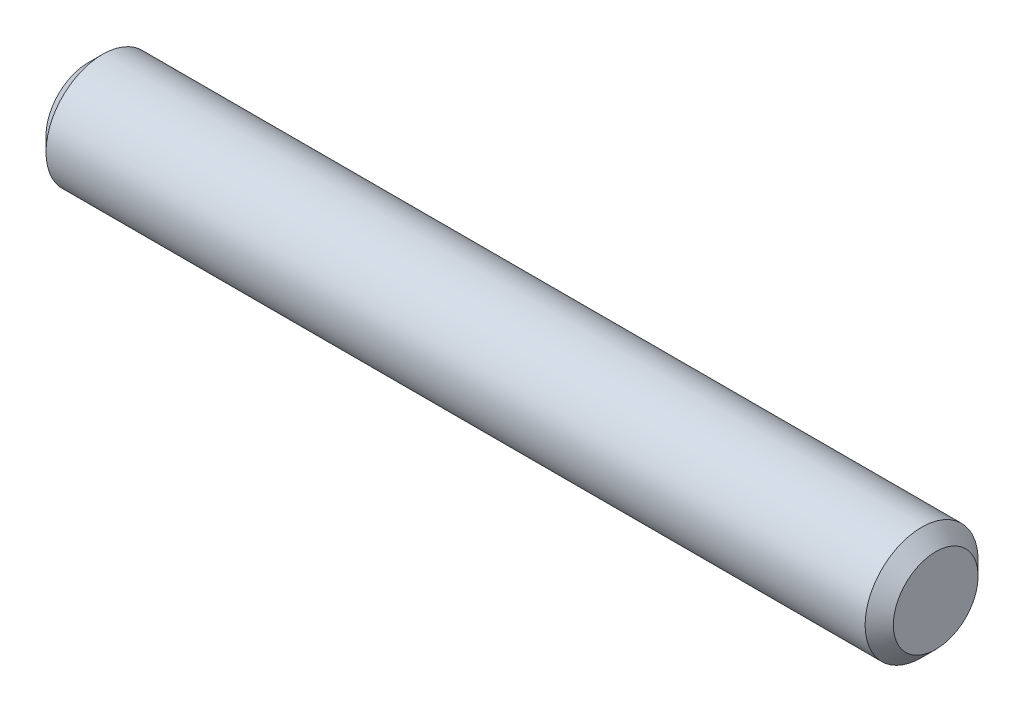
ISO-10303-21;
HEADER;
FILE_DESCRIPTION(('STEP AP214'),'2;1');
FILE_NAME('part.step','',(''),(''),'','','');
FILE_SCHEMA(('AUTOMOTIVE_DESIGN { 1 0 10303 214 1 1 1 1 }'));
ENDSEC;
DATA;
#1=APPLICATION_CONTEXT('core data for automotive mechanical design processes');
#2=APPLICATION_PROTOCOL_DEFINITION('international standard','automotive_design',2000,#1);
#3=PRODUCT_CONTEXT('',#1,'mechanical');
#4=PRODUCT('Part','Part','',(#3));
#5=PRODUCT_RELATED_PRODUCT_CATEGORY('part','',(#4));
#6=PRODUCT_DEFINITION_FORMATION('','',#4);
#7=PRODUCT_DEFINITION_CONTEXT('part definition',#1,'design');
#8=PRODUCT_DEFINITION('design','',#6,#7);
#9=PRODUCT_DEFINITION_SHAPE('','',#8);
#10=(LENGTH_UNIT() NAMED_UNIT(*) SI_UNIT(.MILLI.,.METRE.));
#11=(NAMED_UNIT(*) PLANE_ANGLE_UNIT() SI_UNIT($,.RADIAN.));
#12=(NAMED_UNIT(*) SI_UNIT($,.STERADIAN.) SOLID_ANGLE_UNIT());
#13=UNCERTAINTY_MEASURE_WITH_UNIT(LENGTH_MEASURE(1.E-05),#10,'distance_accuracy_value','');
#14=(GEOMETRIC_REPRESENTATION_CONTEXT(3) GLOBAL_UNCERTAINTY_ASSIGNED_CONTEXT((#13)) GLOBAL_UNIT_ASSIGNED_CONTEXT((#10,
#11,#12)) REPRESENTATION_CONTEXT('',''));
#15=CARTESIAN_POINT('',(0.,0.,0.));
#16=DIRECTION('',(0.,0.,1.));
#17=DIRECTION('',(1.,0.,0.));
#18=AXIS2_PLACEMENT_3D('',#15,#16,#17);
#19=CARTESIAN_POINT('',(15.,0.,0.));
#20=DIRECTION('',(-1.,0.,0.));
#21=DIRECTION('',(0.,0.,1.));
#22=AXIS2_PLACEMENT_3D('',#19,#20,#21);
#23=PLANE('',#22);
#24=CARTESIAN_POINT('',(14.9999999999864,0.,0.));
#25=DIRECTION('',(-1.,0.,0.));
#26=DIRECTION('',(0.,0.,1.));
#27=AXIS2_PLACEMENT_3D('',#24,#25,#26);
#28=CIRCLE('',#27,0.749999999982265);
#29=CARTESIAN_POINT('',(14.9999999999864,0.,0.749999999982265));
#30=VERTEX_POINT('',#29);
#31=EDGE_CURVE('E17',#30,#30,#28,.T.);
#32=ORIENTED_EDGE('',*,*,#31,.F.);
#33=EDGE_LOOP('',(#32));
#34=FACE_BOUND('',#33,.T.);
#35=ADVANCED_FACE('F14',(#34),#23,.F.);
#36=CARTESIAN_POINT('',(0.,0.,0.));
#37=DIRECTION('',(1.,0.,0.));
#38=DIRECTION('',(0.,0.,-1.));
#39=AXIS2_PLACEMENT_3D('',#36,#37,#38);
#40=PLANE('',#39);
#41=CARTESIAN_POINT('',(5.6843418860808E-11,0.,0.));
#42=DIRECTION('',(1.,0.,0.));
#43=DIRECTION('',(0.,0.,-1.));
#44=AXIS2_PLACEMENT_3D('',#41,#42,#43);
#45=CIRCLE('',#44,0.749999999982265);
#46=CARTESIAN_POINT('',(5.6843418860808E-11,0.,-0.749999999982265));
#47=VERTEX_POINT('',#46);
#48=EDGE_CURVE('E26',#47,#47,#45,.T.);
#49=ORIENTED_EDGE('',*,*,#48,.F.);
#50=EDGE_LOOP('',(#49));
#51=FACE_BOUND('',#50,.T.);
#52=ADVANCED_FACE('F37',(#51),#40,.F.);
#53=CARTESIAN_POINT('',(14.7499999999923,0.,0.));
#54=DIRECTION('',(-1.,0.,0.));
#55=DIRECTION('',(0.,0.,1.));
#56=AXIS2_PLACEMENT_3D('',#53,#54,#55);
#57=CONICAL_SURFACE('',#56,0.99999999991951,0.785398163283761);
#58=CARTESIAN_POINT('',(14.75,0.,0.));
#59=DIRECTION('',(-1.,0.,0.));
#60=DIRECTION('',(0.,0.,1.));
#61=AXIS2_PLACEMENT_3D('',#58,#59,#60);
#62=CIRCLE('',#61,1.);
#63=CARTESIAN_POINT('',(14.75,0.,1.));
#64=VERTEX_POINT('',#63);
#65=EDGE_CURVE('E21',#64,#64,#62,.T.);
#66=ORIENTED_EDGE('',*,*,#65,.F.);
#67=EDGE_LOOP('',(#66));
#68=FACE_BOUND('',#67,.T.);
#69=ORIENTED_EDGE('',*,*,#31,.T.);
#70=EDGE_LOOP('',(#69));
#71=FACE_BOUND('',#70,.T.);
#72=ADVANCED_FACE('F34',(#68,#71),#57,.T.);
#73=CARTESIAN_POINT('',(0.250000000050932,0.,0.));
#74=DIRECTION('',(1.,0.,0.));
#75=DIRECTION('',(0.,0.,-1.));
#76=AXIS2_PLACEMENT_3D('',#73,#74,#75);
#77=CONICAL_SURFACE('',#76,0.999999999976353,0.785398163397448);
#78=CARTESIAN_POINT('',(0.25,0.,0.));
#79=DIRECTION('',(-1.,0.,0.));
#80=DIRECTION('',(0.,0.,1.));
#81=AXIS2_PLACEMENT_3D('',#78,#79,#80);
#82=CIRCLE('',#81,1.);
#83=CARTESIAN_POINT('',(0.25,0.,1.));
#84=VERTEX_POINT('',#83);
#85=EDGE_CURVE('E10',#84,#84,#82,.F.);
#86=ORIENTED_EDGE('',*,*,#85,.F.);
#87=EDGE_LOOP('',(#86));
#88=FACE_BOUND('',#87,.T.);
#89=ORIENTED_EDGE('',*,*,#48,.T.);
#90=EDGE_LOOP('',(#89));
#91=FACE_BOUND('',#90,.T.);
#92=ADVANCED_FACE('F45',(#88,#91),#77,.T.);
#93=CARTESIAN_POINT('',(0.,0.,0.));
#94=DIRECTION('',(-1.,0.,0.));
#95=DIRECTION('',(0.,0.,1.));
#96=AXIS2_PLACEMENT_3D('',#93,#94,#95);
#97=CYLINDRICAL_SURFACE('',#96,1.);
#98=ORIENTED_EDGE('',*,*,#85,.T.);
#99=EDGE_LOOP('',(#98));
#100=FACE_BOUND('',#99,.T.);
#101=ORIENTED_EDGE('',*,*,#65,.T.);
#102=EDGE_LOOP('',(#101));
#103=FACE_BOUND('',#102,.T.);
#104=ADVANCED_FACE('F43',(#100,#103),#97,.T.);
#105=CLOSED_SHELL('',(#35,#52,#72,#92,#104));
#106=MANIFOLD_SOLID_BREP('B1',#105);
#107=ADVANCED_BREP_SHAPE_REPRESENTATION('',(#18,#106),#14);
#108=SHAPE_DEFINITION_REPRESENTATION(#9,#107);
ENDSEC;
END-ISO-10303-21;
